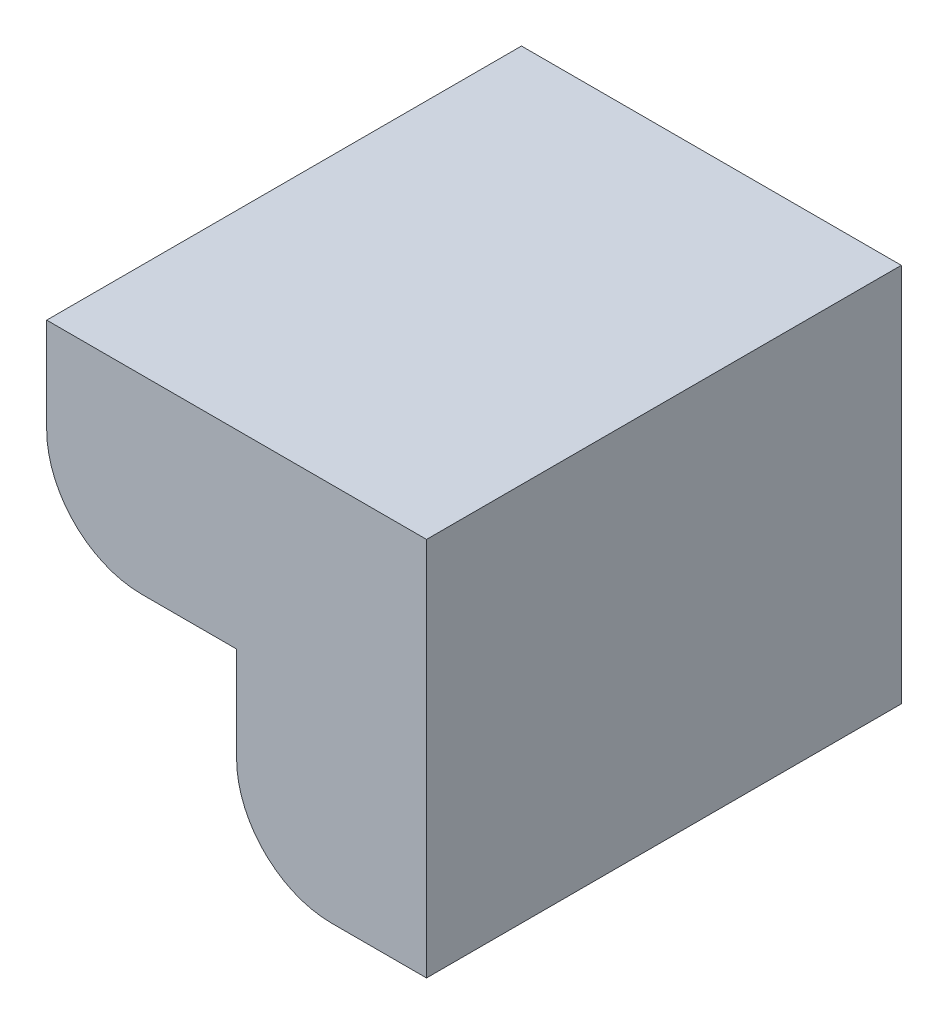
ISO-10303-21;
HEADER;
FILE_DESCRIPTION(('STEP AP214'),'2;1');
FILE_NAME('part.step','',(''),(''),'','','');
FILE_SCHEMA(('AUTOMOTIVE_DESIGN { 1 0 10303 214 1 1 1 1 }'));
ENDSEC;
DATA;
#1=APPLICATION_CONTEXT('core data for automotive mechanical design processes');
#2=APPLICATION_PROTOCOL_DEFINITION('international standard','automotive_design',2000,#1);
#3=PRODUCT_CONTEXT('',#1,'mechanical');
#4=PRODUCT('Part','Part','',(#3));
#5=PRODUCT_RELATED_PRODUCT_CATEGORY('part','',(#4));
#6=PRODUCT_DEFINITION_FORMATION('','',#4);
#7=PRODUCT_DEFINITION_CONTEXT('part definition',#1,'design');
#8=PRODUCT_DEFINITION('design','',#6,#7);
#9=PRODUCT_DEFINITION_SHAPE('','',#8);
#10=(LENGTH_UNIT() NAMED_UNIT(*) SI_UNIT(.MILLI.,.METRE.));
#11=(NAMED_UNIT(*) PLANE_ANGLE_UNIT() SI_UNIT($,.RADIAN.));
#12=(NAMED_UNIT(*) SI_UNIT($,.STERADIAN.) SOLID_ANGLE_UNIT());
#13=UNCERTAINTY_MEASURE_WITH_UNIT(LENGTH_MEASURE(1.E-05),#10,'distance_accuracy_value','');
#14=(GEOMETRIC_REPRESENTATION_CONTEXT(3) GLOBAL_UNCERTAINTY_ASSIGNED_CONTEXT((#13)) GLOBAL_UNIT_ASSIGNED_CONTEXT((#10,
#11,#12)) REPRESENTATION_CONTEXT('',''));
#15=CARTESIAN_POINT('',(0.,0.,0.));
#16=DIRECTION('',(0.,0.,1.));
#17=DIRECTION('',(1.,0.,0.));
#18=AXIS2_PLACEMENT_3D('',#15,#16,#17);
#19=CARTESIAN_POINT('',(-9.99999999999997,9.99999999999995,25.));
#20=DIRECTION('',(1.,0.,0.));
#21=DIRECTION('',(0.,1.,0.));
#22=AXIS2_PLACEMENT_3D('',#19,#20,#21);
#23=PLANE('',#22);
#24=DIRECTION('',(0.,-1.,0.));
#25=VECTOR('',#24,1.);
#26=CARTESIAN_POINT('',(-9.99999999999997,9.99999999999995,0.));
#27=LINE('',#26,#25);
#28=CARTESIAN_POINT('',(-9.99999999999997,9.99999999999995,0.));
#29=VERTEX_POINT('',#28);
#30=CARTESIAN_POINT('',(-9.99999999999995,4.99999999999995,0.));
#31=VERTEX_POINT('',#30);
#32=EDGE_CURVE('E129',#29,#31,#27,.T.);
#33=ORIENTED_EDGE('',*,*,#32,.T.);
#34=DIRECTION('',(0.,0.,-1.));
#35=VECTOR('',#34,1.);
#36=CARTESIAN_POINT('',(-9.99999999999995,4.99999999999995,25.));
#37=LINE('',#36,#35);
#38=CARTESIAN_POINT('',(-9.99999999999995,4.99999999999995,25.));
#39=VERTEX_POINT('',#38);
#40=EDGE_CURVE('E11',#39,#31,#37,.T.);
#41=ORIENTED_EDGE('',*,*,#40,.F.);
#42=DIRECTION('',(0.,-1.,0.));
#43=VECTOR('',#42,1.);
#44=CARTESIAN_POINT('',(-9.99999999999997,9.99999999999995,25.));
#45=LINE('',#44,#43);
#46=CARTESIAN_POINT('',(-9.99999999999997,9.99999999999995,25.));
#47=VERTEX_POINT('',#46);
#48=EDGE_CURVE('E143',#47,#39,#45,.T.);
#49=ORIENTED_EDGE('',*,*,#48,.F.);
#50=DIRECTION('',(0.,0.,-1.));
#51=VECTOR('',#50,1.);
#52=CARTESIAN_POINT('',(-9.99999999999997,9.99999999999995,25.));
#53=LINE('',#52,#51);
#54=EDGE_CURVE('E125',#47,#29,#53,.T.);
#55=ORIENTED_EDGE('',*,*,#54,.T.);
#56=EDGE_LOOP('',(#33,#41,#49,#55));
#57=FACE_BOUND('',#56,.T.);
#58=ADVANCED_FACE('F33',(#57),#23,.F.);
#59=CARTESIAN_POINT('',(-5.,4.99999999999995,25.));
#60=DIRECTION('',(0.,0.,-1.));
#61=DIRECTION('',(-1.,0.,0.));
#62=AXIS2_PLACEMENT_3D('',#59,#60,#61);
#63=CYLINDRICAL_SURFACE('',#62,4.99999999999995);
#64=CARTESIAN_POINT('',(-5.,4.99999999999995,0.));
#65=DIRECTION('',(0.,0.,1.));
#66=DIRECTION('',(-1.,0.,0.));
#67=AXIS2_PLACEMENT_3D('',#64,#65,#66);
#68=CIRCLE('',#67,4.99999999999995);
#69=CARTESIAN_POINT('',(-5.,0.,0.));
#70=VERTEX_POINT('',#69);
#71=EDGE_CURVE('E132',#31,#70,#68,.T.);
#72=ORIENTED_EDGE('',*,*,#71,.T.);
#73=DIRECTION('',(0.,0.,-1.));
#74=VECTOR('',#73,1.);
#75=CARTESIAN_POINT('',(-5.,0.,25.));
#76=LINE('',#75,#74);
#77=CARTESIAN_POINT('',(-5.,0.,25.));
#78=VERTEX_POINT('',#77);
#79=EDGE_CURVE('E41',#78,#70,#76,.T.);
#80=ORIENTED_EDGE('',*,*,#79,.F.);
#81=CARTESIAN_POINT('',(-5.,4.99999999999995,25.));
#82=DIRECTION('',(0.,0.,1.));
#83=DIRECTION('',(-1.,0.,0.));
#84=AXIS2_PLACEMENT_3D('',#81,#82,#83);
#85=CIRCLE('',#84,4.99999999999995);
#86=EDGE_CURVE('E92',#39,#78,#85,.T.);
#87=ORIENTED_EDGE('',*,*,#86,.F.);
#88=ORIENTED_EDGE('',*,*,#40,.T.);
#89=EDGE_LOOP('',(#72,#80,#87,#88));
#90=FACE_BOUND('',#89,.T.);
#91=ADVANCED_FACE('F178',(#90),#63,.T.);
#92=CARTESIAN_POINT('',(0.,0.,25.));
#93=DIRECTION('',(0.,1.,0.));
#94=DIRECTION('',(0.,0.,1.));
#95=AXIS2_PLACEMENT_3D('',#92,#93,#94);
#96=PLANE('',#95);
#97=DIRECTION('',(1.,0.,0.));
#98=VECTOR('',#97,1.);
#99=CARTESIAN_POINT('',(0.,0.,0.));
#100=LINE('',#99,#98);
#101=CARTESIAN_POINT('',(0.,0.,0.));
#102=VERTEX_POINT('',#101);
#103=EDGE_CURVE('E134',#70,#102,#100,.T.);
#104=ORIENTED_EDGE('',*,*,#103,.T.);
#105=DIRECTION('',(0.,0.,-1.));
#106=VECTOR('',#105,1.);
#107=CARTESIAN_POINT('',(0.,0.,25.));
#108=LINE('',#107,#106);
#109=CARTESIAN_POINT('',(0.,0.,25.));
#110=VERTEX_POINT('',#109);
#111=EDGE_CURVE('E150',#110,#102,#108,.T.);
#112=ORIENTED_EDGE('',*,*,#111,.F.);
#113=DIRECTION('',(1.,0.,0.));
#114=VECTOR('',#113,1.);
#115=CARTESIAN_POINT('',(0.,0.,25.));
#116=LINE('',#115,#114);
#117=EDGE_CURVE('E158',#78,#110,#116,.T.);
#118=ORIENTED_EDGE('',*,*,#117,.F.);
#119=ORIENTED_EDGE('',*,*,#79,.T.);
#120=EDGE_LOOP('',(#104,#112,#118,#119));
#121=FACE_BOUND('',#120,.T.);
#122=ADVANCED_FACE('F156',(#121),#96,.F.);
#123=CARTESIAN_POINT('',(0.,-5.00000000000005,25.));
#124=DIRECTION('',(1.,0.,0.));
#125=DIRECTION('',(0.,1.,0.));
#126=AXIS2_PLACEMENT_3D('',#123,#124,#125);
#127=PLANE('',#126);
#128=DIRECTION('',(0.,-1.,0.));
#129=VECTOR('',#128,1.);
#130=CARTESIAN_POINT('',(0.,-5.00000000000005,0.));
#131=LINE('',#130,#129);
#132=CARTESIAN_POINT('',(0.,-5.00000000000005,0.));
#133=VERTEX_POINT('',#132);
#134=EDGE_CURVE('E136',#102,#133,#131,.T.);
#135=ORIENTED_EDGE('',*,*,#134,.T.);
#136=DIRECTION('',(0.,0.,-1.));
#137=VECTOR('',#136,1.);
#138=CARTESIAN_POINT('',(0.,-5.00000000000005,25.));
#139=LINE('',#138,#137);
#140=CARTESIAN_POINT('',(0.,-5.00000000000005,25.));
#141=VERTEX_POINT('',#140);
#142=EDGE_CURVE('E147',#141,#133,#139,.T.);
#143=ORIENTED_EDGE('',*,*,#142,.F.);
#144=DIRECTION('',(0.,-1.,0.));
#145=VECTOR('',#144,1.);
#146=CARTESIAN_POINT('',(0.,-5.00000000000005,25.));
#147=LINE('',#146,#145);
#148=EDGE_CURVE('E170',#110,#141,#147,.T.);
#149=ORIENTED_EDGE('',*,*,#148,.F.);
#150=ORIENTED_EDGE('',*,*,#111,.T.);
#151=EDGE_LOOP('',(#135,#143,#149,#150));
#152=FACE_BOUND('',#151,.T.);
#153=ADVANCED_FACE('F166',(#152),#127,.F.);
#154=CARTESIAN_POINT('',(5.,-5.00000000000005,25.));
#155=DIRECTION('',(0.,0.,-1.));
#156=DIRECTION('',(-1.,0.,0.));
#157=AXIS2_PLACEMENT_3D('',#154,#155,#156);
#158=CYLINDRICAL_SURFACE('',#157,5.00000000000001);
#159=CARTESIAN_POINT('',(5.,-5.00000000000005,0.));
#160=DIRECTION('',(0.,0.,1.));
#161=DIRECTION('',(-1.,0.,0.));
#162=AXIS2_PLACEMENT_3D('',#159,#160,#161);
#163=CIRCLE('',#162,5.00000000000001);
#164=CARTESIAN_POINT('',(5.00000000000003,-10.0000000000001,0.));
#165=VERTEX_POINT('',#164);
#166=EDGE_CURVE('E138',#133,#165,#163,.T.);
#167=ORIENTED_EDGE('',*,*,#166,.T.);
#168=DIRECTION('',(0.,0.,-1.));
#169=VECTOR('',#168,1.);
#170=CARTESIAN_POINT('',(5.00000000000003,-10.0000000000001,25.));
#171=LINE('',#170,#169);
#172=CARTESIAN_POINT('',(5.00000000000003,-10.0000000000001,25.));
#173=VERTEX_POINT('',#172);
#174=EDGE_CURVE('E120',#173,#165,#171,.T.);
#175=ORIENTED_EDGE('',*,*,#174,.F.);
#176=CARTESIAN_POINT('',(5.,-5.00000000000005,25.));
#177=DIRECTION('',(0.,0.,1.));
#178=DIRECTION('',(-1.,0.,0.));
#179=AXIS2_PLACEMENT_3D('',#176,#177,#178);
#180=CIRCLE('',#179,5.00000000000001);
#181=EDGE_CURVE('E111',#141,#173,#180,.T.);
#182=ORIENTED_EDGE('',*,*,#181,.F.);
#183=ORIENTED_EDGE('',*,*,#142,.T.);
#184=EDGE_LOOP('',(#167,#175,#182,#183));
#185=FACE_BOUND('',#184,.T.);
#186=ADVANCED_FACE('F169',(#185),#158,.T.);
#187=CARTESIAN_POINT('',(10.0000000000001,-10.0000000000001,25.));
#188=DIRECTION('',(0.,1.,0.));
#189=DIRECTION('',(-1.,0.,0.));
#190=AXIS2_PLACEMENT_3D('',#187,#188,#189);
#191=PLANE('',#190);
#192=DIRECTION('',(1.,0.,0.));
#193=VECTOR('',#192,1.);
#194=CARTESIAN_POINT('',(10.0000000000001,-10.0000000000001,0.));
#195=LINE('',#194,#193);
#196=CARTESIAN_POINT('',(10.0000000000001,-10.0000000000001,0.));
#197=VERTEX_POINT('',#196);
#198=EDGE_CURVE('E119',#165,#197,#195,.T.);
#199=ORIENTED_EDGE('',*,*,#198,.T.);
#200=DIRECTION('',(0.,0.,-1.));
#201=VECTOR('',#200,1.);
#202=CARTESIAN_POINT('',(10.0000000000001,-10.0000000000001,25.));
#203=LINE('',#202,#201);
#204=CARTESIAN_POINT('',(10.0000000000001,-10.0000000000001,25.));
#205=VERTEX_POINT('',#204);
#206=EDGE_CURVE('E116',#205,#197,#203,.T.);
#207=ORIENTED_EDGE('',*,*,#206,.F.);
#208=DIRECTION('',(1.,0.,0.));
#209=VECTOR('',#208,1.);
#210=CARTESIAN_POINT('',(10.0000000000001,-10.0000000000001,25.));
#211=LINE('',#210,#209);
#212=EDGE_CURVE('E105',#173,#205,#211,.T.);
#213=ORIENTED_EDGE('',*,*,#212,.F.);
#214=ORIENTED_EDGE('',*,*,#174,.T.);
#215=EDGE_LOOP('',(#199,#207,#213,#214));
#216=FACE_BOUND('',#215,.T.);
#217=ADVANCED_FACE('F117',(#216),#191,.F.);
#218=CARTESIAN_POINT('',(10.,9.99999999999995,25.));
#219=DIRECTION('',(-1.,0.,0.));
#220=DIRECTION('',(0.,-1.,0.));
#221=AXIS2_PLACEMENT_3D('',#218,#219,#220);
#222=PLANE('',#221);
#223=DIRECTION('',(0.,1.,0.));
#224=VECTOR('',#223,1.);
#225=CARTESIAN_POINT('',(10.,9.99999999999995,0.));
#226=LINE('',#225,#224);
#227=CARTESIAN_POINT('',(10.,9.99999999999995,0.));
#228=VERTEX_POINT('',#227);
#229=EDGE_CURVE('E78',#197,#228,#226,.T.);
#230=ORIENTED_EDGE('',*,*,#229,.T.);
#231=DIRECTION('',(0.,0.,-1.));
#232=VECTOR('',#231,1.);
#233=CARTESIAN_POINT('',(10.,9.99999999999995,25.));
#234=LINE('',#233,#232);
#235=CARTESIAN_POINT('',(10.,9.99999999999995,25.));
#236=VERTEX_POINT('',#235);
#237=EDGE_CURVE('E121',#236,#228,#234,.T.);
#238=ORIENTED_EDGE('',*,*,#237,.F.);
#239=DIRECTION('',(0.,1.,0.));
#240=VECTOR('',#239,1.);
#241=CARTESIAN_POINT('',(10.,9.99999999999995,25.));
#242=LINE('',#241,#240);
#243=EDGE_CURVE('E109',#205,#236,#242,.T.);
#244=ORIENTED_EDGE('',*,*,#243,.F.);
#245=ORIENTED_EDGE('',*,*,#206,.T.);
#246=EDGE_LOOP('',(#230,#238,#244,#245));
#247=FACE_BOUND('',#246,.T.);
#248=ADVANCED_FACE('F123',(#247),#222,.F.);
#249=CARTESIAN_POINT('',(-9.99999999999997,9.99999999999995,25.));
#250=DIRECTION('',(0.,-1.,0.));
#251=DIRECTION('',(0.,0.,-1.));
#252=AXIS2_PLACEMENT_3D('',#249,#250,#251);
#253=PLANE('',#252);
#254=DIRECTION('',(-1.,0.,0.));
#255=VECTOR('',#254,1.);
#256=CARTESIAN_POINT('',(-9.99999999999997,9.99999999999995,0.));
#257=LINE('',#256,#255);
#258=EDGE_CURVE('E84',#228,#29,#257,.T.);
#259=ORIENTED_EDGE('',*,*,#258,.T.);
#260=ORIENTED_EDGE('',*,*,#54,.F.);
#261=DIRECTION('',(-1.,0.,0.));
#262=VECTOR('',#261,1.);
#263=CARTESIAN_POINT('',(-9.99999999999997,9.99999999999995,25.));
#264=LINE('',#263,#262);
#265=EDGE_CURVE('E49',#236,#47,#264,.T.);
#266=ORIENTED_EDGE('',*,*,#265,.F.);
#267=ORIENTED_EDGE('',*,*,#237,.T.);
#268=EDGE_LOOP('',(#259,#260,#266,#267));
#269=FACE_BOUND('',#268,.T.);
#270=ADVANCED_FACE('F194',(#269),#253,.F.);
#271=CARTESIAN_POINT('',(-5.,4.99999999999995,25.));
#272=DIRECTION('',(0.,0.,-1.));
#273=DIRECTION('',(-1.,0.,0.));
#274=AXIS2_PLACEMENT_3D('',#271,#272,#273);
#275=PLANE('',#274);
#276=ORIENTED_EDGE('',*,*,#48,.T.);
#277=ORIENTED_EDGE('',*,*,#86,.T.);
#278=ORIENTED_EDGE('',*,*,#117,.T.);
#279=ORIENTED_EDGE('',*,*,#148,.T.);
#280=ORIENTED_EDGE('',*,*,#181,.T.);
#281=ORIENTED_EDGE('',*,*,#212,.T.);
#282=ORIENTED_EDGE('',*,*,#243,.T.);
#283=ORIENTED_EDGE('',*,*,#265,.T.);
#284=EDGE_LOOP('',(#276,#277,#278,#279,#280,#281,#282,#283));
#285=FACE_BOUND('',#284,.T.);
#286=ADVANCED_FACE('F107',(#285),#275,.F.);
#287=CARTESIAN_POINT('',(-5.,4.99999999999995,0.));
#288=DIRECTION('',(0.,0.,-1.));
#289=DIRECTION('',(-1.,0.,0.));
#290=AXIS2_PLACEMENT_3D('',#287,#288,#289);
#291=PLANE('',#290);
#292=ORIENTED_EDGE('',*,*,#32,.F.);
#293=ORIENTED_EDGE('',*,*,#258,.F.);
#294=ORIENTED_EDGE('',*,*,#229,.F.);
#295=ORIENTED_EDGE('',*,*,#198,.F.);
#296=ORIENTED_EDGE('',*,*,#166,.F.);
#297=ORIENTED_EDGE('',*,*,#134,.F.);
#298=ORIENTED_EDGE('',*,*,#103,.F.);
#299=ORIENTED_EDGE('',*,*,#71,.F.);
#300=EDGE_LOOP('',(#292,#293,#294,#295,#296,#297,#298,#299));
#301=FACE_BOUND('',#300,.T.);
#302=ADVANCED_FACE('F162',(#301),#291,.T.);
#303=CLOSED_SHELL('',(#58,#91,#122,#153,#186,#217,#248,#270,#286,#302));
#304=MANIFOLD_SOLID_BREP('B2',#303);
#305=ADVANCED_BREP_SHAPE_REPRESENTATION('',(#18,#304),#14);
#306=SHAPE_DEFINITION_REPRESENTATION(#9,#305);
ENDSEC;
END-ISO-10303-21;
